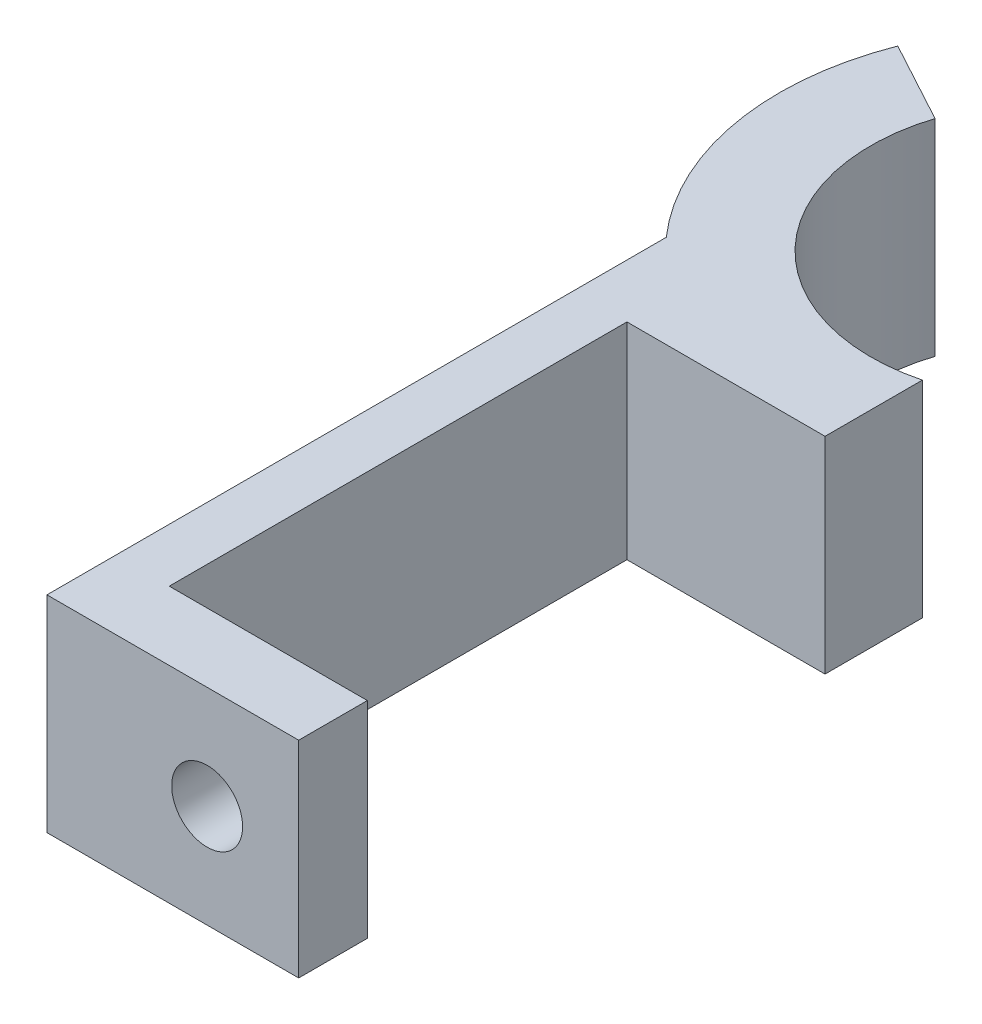
ISO-10303-21;
HEADER;
FILE_DESCRIPTION(('STEP AP214'),'2;1');
FILE_NAME('part.step','',(''),(''),'','','');
FILE_SCHEMA(('AUTOMOTIVE_DESIGN { 1 0 10303 214 1 1 1 1 }'));
ENDSEC;
DATA;
#1=APPLICATION_CONTEXT('core data for automotive mechanical design processes');
#2=APPLICATION_PROTOCOL_DEFINITION('international standard','automotive_design',2000,#1);
#3=PRODUCT_CONTEXT('',#1,'mechanical');
#4=PRODUCT('Part','Part','',(#3));
#5=PRODUCT_RELATED_PRODUCT_CATEGORY('part','',(#4));
#6=PRODUCT_DEFINITION_FORMATION('','',#4);
#7=PRODUCT_DEFINITION_CONTEXT('part definition',#1,'design');
#8=PRODUCT_DEFINITION('design','',#6,#7);
#9=PRODUCT_DEFINITION_SHAPE('','',#8);
#10=(LENGTH_UNIT() NAMED_UNIT(*) SI_UNIT(.MILLI.,.METRE.));
#11=(NAMED_UNIT(*) PLANE_ANGLE_UNIT() SI_UNIT($,.RADIAN.));
#12=(NAMED_UNIT(*) SI_UNIT($,.STERADIAN.) SOLID_ANGLE_UNIT());
#13=UNCERTAINTY_MEASURE_WITH_UNIT(LENGTH_MEASURE(1.E-05),#10,'distance_accuracy_value','');
#14=(GEOMETRIC_REPRESENTATION_CONTEXT(3) GLOBAL_UNCERTAINTY_ASSIGNED_CONTEXT((#13)) GLOBAL_UNIT_ASSIGNED_CONTEXT((#10,
#11,#12)) REPRESENTATION_CONTEXT('',''));
#15=CARTESIAN_POINT('',(0.,0.,0.));
#16=DIRECTION('',(0.,0.,1.));
#17=DIRECTION('',(1.,0.,0.));
#18=AXIS2_PLACEMENT_3D('',#15,#16,#17);
#19=CARTESIAN_POINT('',(9.30094670457775,9.,-17.1481964668759));
#20=DIRECTION('',(0.476772149483138,0.,-0.879026915103985));
#21=DIRECTION('',(-0.879026915103985,0.,-0.476772149483138));
#22=AXIS2_PLACEMENT_3D('',#19,#20,#21);
#23=PLANE('',#22);
#24=DIRECTION('',(0.879026915103985,0.,0.476772149483138));
#25=VECTOR('',#24,1.);
#26=CARTESIAN_POINT('',(9.30094670457775,0.,-17.1481964668759));
#27=LINE('',#26,#25);
#28=CARTESIAN_POINT('',(-7.68043173249966,0.,-26.3586633587506));
#29=VERTEX_POINT('',#28);
#30=CARTESIAN_POINT('',(-4.12238743204992,0.,-24.4288289021105));
#31=VERTEX_POINT('',#30);
#32=EDGE_CURVE('E153',#29,#31,#27,.T.);
#33=ORIENTED_EDGE('',*,*,#32,.F.);
#34=DIRECTION('',(0.,-1.,0.));
#35=VECTOR('',#34,1.);
#36=CARTESIAN_POINT('',(-7.68043173249966,9.,-26.3586633587506));
#37=LINE('',#36,#35);
#38=CARTESIAN_POINT('',(-7.68043173249966,9.,-26.3586633587506));
#39=VERTEX_POINT('',#38);
#40=EDGE_CURVE('E11',#39,#29,#37,.T.);
#41=ORIENTED_EDGE('',*,*,#40,.F.);
#42=DIRECTION('',(0.879026915103985,0.,0.476772149483138));
#43=VECTOR('',#42,1.);
#44=CARTESIAN_POINT('',(9.30094670457775,9.,-17.1481964668759));
#45=LINE('',#44,#43);
#46=CARTESIAN_POINT('',(-4.12238743204992,9.,-24.4288289021105));
#47=VERTEX_POINT('',#46);
#48=EDGE_CURVE('E189',#39,#47,#45,.T.);
#49=ORIENTED_EDGE('',*,*,#48,.T.);
#50=DIRECTION('',(0.,-1.,0.));
#51=VECTOR('',#50,1.);
#52=CARTESIAN_POINT('',(-4.12238743204992,9.,-24.4288289021105));
#53=LINE('',#52,#51);
#54=EDGE_CURVE('E59',#47,#31,#53,.T.);
#55=ORIENTED_EDGE('',*,*,#54,.T.);
#56=EDGE_LOOP('',(#33,#41,#49,#55));
#57=FACE_BOUND('',#56,.T.);
#58=ADVANCED_FACE('F41',(#57),#23,.T.);
#59=CARTESIAN_POINT('',(3.5,9.,-22.));
#60=DIRECTION('',(0.,-1.,0.));
#61=DIRECTION('',(0.,0.,-1.));
#62=AXIS2_PLACEMENT_3D('',#59,#60,#61);
#63=CYLINDRICAL_SURFACE('',#62,12.);
#64=CARTESIAN_POINT('',(3.5,0.,-22.));
#65=DIRECTION('',(0.,1.,0.));
#66=DIRECTION('',(0.,0.,1.));
#67=AXIS2_PLACEMENT_3D('',#64,#65,#66);
#68=CIRCLE('',#67,12.);
#69=CARTESIAN_POINT('',(-5.5,0.,-14.0627460668062));
#70=VERTEX_POINT('',#69);
#71=EDGE_CURVE('E156',#29,#70,#68,.T.);
#72=ORIENTED_EDGE('',*,*,#71,.T.);
#73=DIRECTION('',(0.,-1.,0.));
#74=VECTOR('',#73,1.);
#75=CARTESIAN_POINT('',(-5.5,9.,-14.0627460668062));
#76=LINE('',#75,#74);
#77=CARTESIAN_POINT('',(-5.5,9.,-14.0627460668062));
#78=VERTEX_POINT('',#77);
#79=EDGE_CURVE('E51',#78,#70,#76,.T.);
#80=ORIENTED_EDGE('',*,*,#79,.F.);
#81=CARTESIAN_POINT('',(3.5,9.,-22.));
#82=DIRECTION('',(0.,1.,0.));
#83=DIRECTION('',(0.,0.,1.));
#84=AXIS2_PLACEMENT_3D('',#81,#82,#83);
#85=CIRCLE('',#84,12.);
#86=EDGE_CURVE('E233',#39,#78,#85,.T.);
#87=ORIENTED_EDGE('',*,*,#86,.F.);
#88=ORIENTED_EDGE('',*,*,#40,.T.);
#89=EDGE_LOOP('',(#72,#80,#87,#88));
#90=FACE_BOUND('',#89,.T.);
#91=ADVANCED_FACE('F218',(#90),#63,.T.);
#92=CARTESIAN_POINT('',(-5.5,9.,0.));
#93=DIRECTION('',(-1.,0.,0.));
#94=DIRECTION('',(0.,0.,1.));
#95=AXIS2_PLACEMENT_3D('',#92,#93,#94);
#96=PLANE('',#95);
#97=DIRECTION('',(0.,0.,-1.));
#98=VECTOR('',#97,1.);
#99=CARTESIAN_POINT('',(-5.5,0.,0.));
#100=LINE('',#99,#98);
#101=CARTESIAN_POINT('',(-5.5,0.,13.));
#102=VERTEX_POINT('',#101);
#103=EDGE_CURVE('E160',#102,#70,#100,.T.);
#104=ORIENTED_EDGE('',*,*,#103,.F.);
#105=DIRECTION('',(0.,-1.,0.));
#106=VECTOR('',#105,1.);
#107=CARTESIAN_POINT('',(-5.5,9.,13.));
#108=LINE('',#107,#106);
#109=CARTESIAN_POINT('',(-5.5,9.,13.));
#110=VERTEX_POINT('',#109);
#111=EDGE_CURVE('E205',#110,#102,#108,.T.);
#112=ORIENTED_EDGE('',*,*,#111,.F.);
#113=DIRECTION('',(0.,0.,-1.));
#114=VECTOR('',#113,1.);
#115=CARTESIAN_POINT('',(-5.5,9.,0.));
#116=LINE('',#115,#114);
#117=EDGE_CURVE('E215',#110,#78,#116,.T.);
#118=ORIENTED_EDGE('',*,*,#117,.T.);
#119=ORIENTED_EDGE('',*,*,#79,.T.);
#120=EDGE_LOOP('',(#104,#112,#118,#119));
#121=FACE_BOUND('',#120,.T.);
#122=ADVANCED_FACE('F213',(#121),#96,.T.);
#123=CARTESIAN_POINT('',(0.,9.,13.));
#124=DIRECTION('',(0.,0.,-1.));
#125=DIRECTION('',(-1.,0.,0.));
#126=AXIS2_PLACEMENT_3D('',#123,#124,#125);
#127=PLANE('',#126);
#128=CARTESIAN_POINT('',(1.5,4.5,13.));
#129=DIRECTION('',(0.,0.,1.));
#130=DIRECTION('',(1.,0.,0.));
#131=AXIS2_PLACEMENT_3D('',#128,#129,#130);
#132=CIRCLE('',#131,1.55);
#133=CARTESIAN_POINT('',(3.05,4.5,13.));
#134=VERTEX_POINT('',#133);
#135=EDGE_CURVE('E344',#134,#134,#132,.T.);
#136=ORIENTED_EDGE('',*,*,#135,.F.);
#137=EDGE_LOOP('',(#136));
#138=FACE_BOUND('',#137,.T.);
#139=DIRECTION('',(1.,0.,0.));
#140=VECTOR('',#139,1.);
#141=CARTESIAN_POINT('',(0.,0.,13.));
#142=LINE('',#141,#140);
#143=CARTESIAN_POINT('',(5.5,0.,13.));
#144=VERTEX_POINT('',#143);
#145=EDGE_CURVE('E164',#102,#144,#142,.T.);
#146=ORIENTED_EDGE('',*,*,#145,.T.);
#147=DIRECTION('',(0.,-1.,0.));
#148=VECTOR('',#147,1.);
#149=CARTESIAN_POINT('',(5.5,9.,13.));
#150=LINE('',#149,#148);
#151=CARTESIAN_POINT('',(5.5,9.,13.));
#152=VERTEX_POINT('',#151);
#153=EDGE_CURVE('E202',#152,#144,#150,.T.);
#154=ORIENTED_EDGE('',*,*,#153,.F.);
#155=DIRECTION('',(1.,0.,0.));
#156=VECTOR('',#155,1.);
#157=CARTESIAN_POINT('',(0.,9.,13.));
#158=LINE('',#157,#156);
#159=EDGE_CURVE('E228',#110,#152,#158,.T.);
#160=ORIENTED_EDGE('',*,*,#159,.F.);
#161=ORIENTED_EDGE('',*,*,#111,.T.);
#162=EDGE_LOOP('',(#146,#154,#160,#161));
#163=FACE_BOUND('',#162,.T.);
#164=ADVANCED_FACE('F225',(#138,#163),#127,.F.);
#165=CARTESIAN_POINT('',(5.50000000000001,9.,0.));
#166=DIRECTION('',(1.,0.,0.));
#167=DIRECTION('',(0.,0.,-1.));
#168=AXIS2_PLACEMENT_3D('',#165,#166,#167);
#169=PLANE('',#168);
#170=DIRECTION('',(0.,0.,1.));
#171=VECTOR('',#170,1.);
#172=CARTESIAN_POINT('',(5.50000000000001,0.,0.));
#173=LINE('',#172,#171);
#174=CARTESIAN_POINT('',(5.5,0.,10.));
#175=VERTEX_POINT('',#174);
#176=EDGE_CURVE('E168',#175,#144,#173,.T.);
#177=ORIENTED_EDGE('',*,*,#176,.F.);
#178=DIRECTION('',(0.,-1.,0.));
#179=VECTOR('',#178,1.);
#180=CARTESIAN_POINT('',(5.5,9.,10.));
#181=LINE('',#180,#179);
#182=CARTESIAN_POINT('',(5.5,9.,10.));
#183=VERTEX_POINT('',#182);
#184=EDGE_CURVE('E199',#183,#175,#181,.T.);
#185=ORIENTED_EDGE('',*,*,#184,.F.);
#186=DIRECTION('',(0.,0.,1.));
#187=VECTOR('',#186,1.);
#188=CARTESIAN_POINT('',(5.50000000000001,9.,0.));
#189=LINE('',#188,#187);
#190=EDGE_CURVE('E231',#183,#152,#189,.T.);
#191=ORIENTED_EDGE('',*,*,#190,.T.);
#192=ORIENTED_EDGE('',*,*,#153,.T.);
#193=EDGE_LOOP('',(#177,#185,#191,#192));
#194=FACE_BOUND('',#193,.T.);
#195=ADVANCED_FACE('F271',(#194),#169,.T.);
#196=CARTESIAN_POINT('',(0.,9.,10.));
#197=DIRECTION('',(0.,0.,-1.));
#198=DIRECTION('',(-1.,0.,0.));
#199=AXIS2_PLACEMENT_3D('',#196,#197,#198);
#200=PLANE('',#199);
#201=CARTESIAN_POINT('',(1.5,4.5,10.));
#202=DIRECTION('',(0.,0.,-1.));
#203=DIRECTION('',(-1.,0.,0.));
#204=AXIS2_PLACEMENT_3D('',#201,#202,#203);
#205=CIRCLE('',#204,1.55);
#206=CARTESIAN_POINT('',(-0.0499999999999997,4.5,10.));
#207=VERTEX_POINT('',#206);
#208=EDGE_CURVE('E44',#207,#207,#205,.T.);
#209=ORIENTED_EDGE('',*,*,#208,.F.);
#210=EDGE_LOOP('',(#209));
#211=FACE_BOUND('',#210,.T.);
#212=DIRECTION('',(1.,0.,0.));
#213=VECTOR('',#212,1.);
#214=CARTESIAN_POINT('',(0.,0.,10.));
#215=LINE('',#214,#213);
#216=CARTESIAN_POINT('',(-3.15594387591767,0.,10.));
#217=VERTEX_POINT('',#216);
#218=EDGE_CURVE('E172',#217,#175,#215,.T.);
#219=ORIENTED_EDGE('',*,*,#218,.F.);
#220=DIRECTION('',(0.,-1.,0.));
#221=VECTOR('',#220,1.);
#222=CARTESIAN_POINT('',(-3.15594387591767,9.,10.));
#223=LINE('',#222,#221);
#224=CARTESIAN_POINT('',(-3.15594387591767,9.,10.));
#225=VERTEX_POINT('',#224);
#226=EDGE_CURVE('E196',#225,#217,#223,.T.);
#227=ORIENTED_EDGE('',*,*,#226,.F.);
#228=DIRECTION('',(1.,0.,0.));
#229=VECTOR('',#228,1.);
#230=CARTESIAN_POINT('',(0.,9.,10.));
#231=LINE('',#230,#229);
#232=EDGE_CURVE('E242',#225,#183,#231,.T.);
#233=ORIENTED_EDGE('',*,*,#232,.T.);
#234=ORIENTED_EDGE('',*,*,#184,.T.);
#235=EDGE_LOOP('',(#219,#227,#233,#234));
#236=FACE_BOUND('',#235,.T.);
#237=ADVANCED_FACE('F275',(#211,#236),#200,.T.);
#238=CARTESIAN_POINT('',(-3.15594387591767,9.,0.));
#239=DIRECTION('',(1.,0.,0.));
#240=DIRECTION('',(0.,0.,-1.));
#241=AXIS2_PLACEMENT_3D('',#238,#239,#240);
#242=PLANE('',#241);
#243=DIRECTION('',(0.,0.,1.));
#244=VECTOR('',#243,1.);
#245=CARTESIAN_POINT('',(-3.15594387591767,0.,0.));
#246=LINE('',#245,#244);
#247=CARTESIAN_POINT('',(-3.15594387591767,0.,-10.));
#248=VERTEX_POINT('',#247);
#249=EDGE_CURVE('E176',#248,#217,#246,.T.);
#250=ORIENTED_EDGE('',*,*,#249,.F.);
#251=DIRECTION('',(0.,-1.,0.));
#252=VECTOR('',#251,1.);
#253=CARTESIAN_POINT('',(-3.15594387591767,9.,-10.));
#254=LINE('',#253,#252);
#255=CARTESIAN_POINT('',(-3.15594387591767,9.,-10.));
#256=VERTEX_POINT('',#255);
#257=EDGE_CURVE('E131',#256,#248,#254,.T.);
#258=ORIENTED_EDGE('',*,*,#257,.F.);
#259=DIRECTION('',(0.,0.,1.));
#260=VECTOR('',#259,1.);
#261=CARTESIAN_POINT('',(-3.15594387591767,9.,0.));
#262=LINE('',#261,#260);
#263=EDGE_CURVE('E142',#256,#225,#262,.T.);
#264=ORIENTED_EDGE('',*,*,#263,.T.);
#265=ORIENTED_EDGE('',*,*,#226,.T.);
#266=EDGE_LOOP('',(#250,#258,#264,#265));
#267=FACE_BOUND('',#266,.T.);
#268=ADVANCED_FACE('F248',(#267),#242,.T.);
#269=CARTESIAN_POINT('',(0.,9.,-10.));
#270=DIRECTION('',(0.,0.,1.));
#271=DIRECTION('',(1.,0.,0.));
#272=AXIS2_PLACEMENT_3D('',#269,#270,#271);
#273=PLANE('',#272);
#274=DIRECTION('',(-1.,0.,0.));
#275=VECTOR('',#274,1.);
#276=CARTESIAN_POINT('',(0.,0.,-10.));
#277=LINE('',#276,#275);
#278=CARTESIAN_POINT('',(5.5,0.,-10.));
#279=VERTEX_POINT('',#278);
#280=EDGE_CURVE('E126',#279,#248,#277,.T.);
#281=ORIENTED_EDGE('',*,*,#280,.F.);
#282=DIRECTION('',(0.,-1.,0.));
#283=VECTOR('',#282,1.);
#284=CARTESIAN_POINT('',(5.5,9.,-10.));
#285=LINE('',#284,#283);
#286=CARTESIAN_POINT('',(5.5,9.,-10.));
#287=VERTEX_POINT('',#286);
#288=EDGE_CURVE('E121',#287,#279,#285,.T.);
#289=ORIENTED_EDGE('',*,*,#288,.F.);
#290=DIRECTION('',(-1.,0.,0.));
#291=VECTOR('',#290,1.);
#292=CARTESIAN_POINT('',(0.,9.,-10.));
#293=LINE('',#292,#291);
#294=EDGE_CURVE('E124',#287,#256,#293,.T.);
#295=ORIENTED_EDGE('',*,*,#294,.T.);
#296=ORIENTED_EDGE('',*,*,#257,.T.);
#297=EDGE_LOOP('',(#281,#289,#295,#296));
#298=FACE_BOUND('',#297,.T.);
#299=ADVANCED_FACE('F123',(#298),#273,.T.);
#300=CARTESIAN_POINT('',(5.5,9.,0.));
#301=DIRECTION('',(1.,0.,0.));
#302=DIRECTION('',(0.,0.,-1.));
#303=AXIS2_PLACEMENT_3D('',#300,#301,#302);
#304=PLANE('',#303);
#305=DIRECTION('',(0.,0.,1.));
#306=VECTOR('',#305,1.);
#307=CARTESIAN_POINT('',(5.5,0.,0.));
#308=LINE('',#307,#306);
#309=CARTESIAN_POINT('',(5.5,0.,-14.2540333075852));
#310=VERTEX_POINT('',#309);
#311=EDGE_CURVE('E182',#310,#279,#308,.T.);
#312=ORIENTED_EDGE('',*,*,#311,.F.);
#313=DIRECTION('',(0.,-1.,0.));
#314=VECTOR('',#313,1.);
#315=CARTESIAN_POINT('',(5.5,9.,-14.2540333075852));
#316=LINE('',#315,#314);
#317=CARTESIAN_POINT('',(5.5,9.,-14.2540333075852));
#318=VERTEX_POINT('',#317);
#319=EDGE_CURVE('E90',#318,#310,#316,.T.);
#320=ORIENTED_EDGE('',*,*,#319,.F.);
#321=DIRECTION('',(0.,0.,1.));
#322=VECTOR('',#321,1.);
#323=CARTESIAN_POINT('',(5.5,9.,0.));
#324=LINE('',#323,#322);
#325=EDGE_CURVE('E139',#318,#287,#324,.T.);
#326=ORIENTED_EDGE('',*,*,#325,.T.);
#327=ORIENTED_EDGE('',*,*,#288,.T.);
#328=EDGE_LOOP('',(#312,#320,#326,#327));
#329=FACE_BOUND('',#328,.T.);
#330=ADVANCED_FACE('F145',(#329),#304,.T.);
#331=CARTESIAN_POINT('',(3.5,9.,-22.));
#332=DIRECTION('',(0.,-1.,0.));
#333=DIRECTION('',(0.,0.,-1.));
#334=AXIS2_PLACEMENT_3D('',#331,#332,#333);
#335=CYLINDRICAL_SURFACE('',#334,8.);
#336=CARTESIAN_POINT('',(3.5,0.,-22.));
#337=DIRECTION('',(0.,1.,0.));
#338=DIRECTION('',(0.,0.,1.));
#339=AXIS2_PLACEMENT_3D('',#336,#337,#338);
#340=CIRCLE('',#339,8.);
#341=EDGE_CURVE('E185',#31,#310,#340,.T.);
#342=ORIENTED_EDGE('',*,*,#341,.F.);
#343=ORIENTED_EDGE('',*,*,#54,.F.);
#344=CARTESIAN_POINT('',(3.5,9.,-22.));
#345=DIRECTION('',(0.,1.,0.));
#346=DIRECTION('',(0.,0.,1.));
#347=AXIS2_PLACEMENT_3D('',#344,#345,#346);
#348=CIRCLE('',#347,8.);
#349=EDGE_CURVE('E147',#47,#318,#348,.T.);
#350=ORIENTED_EDGE('',*,*,#349,.T.);
#351=ORIENTED_EDGE('',*,*,#319,.T.);
#352=EDGE_LOOP('',(#342,#343,#350,#351));
#353=FACE_BOUND('',#352,.T.);
#354=ADVANCED_FACE('F250',(#353),#335,.F.);
#355=CARTESIAN_POINT('',(0.,9.,0.));
#356=DIRECTION('',(0.,1.,0.));
#357=DIRECTION('',(0.,0.,1.));
#358=AXIS2_PLACEMENT_3D('',#355,#356,#357);
#359=PLANE('',#358);
#360=ORIENTED_EDGE('',*,*,#48,.F.);
#361=ORIENTED_EDGE('',*,*,#86,.T.);
#362=ORIENTED_EDGE('',*,*,#117,.F.);
#363=ORIENTED_EDGE('',*,*,#159,.T.);
#364=ORIENTED_EDGE('',*,*,#190,.F.);
#365=ORIENTED_EDGE('',*,*,#232,.F.);
#366=ORIENTED_EDGE('',*,*,#263,.F.);
#367=ORIENTED_EDGE('',*,*,#294,.F.);
#368=ORIENTED_EDGE('',*,*,#325,.F.);
#369=ORIENTED_EDGE('',*,*,#349,.F.);
#370=EDGE_LOOP('',(#360,#361,#362,#363,#364,#365,#366,#367,#368,#369));
#371=FACE_BOUND('',#370,.T.);
#372=ADVANCED_FACE('F137',(#371),#359,.T.);
#373=CARTESIAN_POINT('',(0.,0.,0.));
#374=DIRECTION('',(0.,1.,0.));
#375=DIRECTION('',(0.,0.,1.));
#376=AXIS2_PLACEMENT_3D('',#373,#374,#375);
#377=PLANE('',#376);
#378=ORIENTED_EDGE('',*,*,#32,.T.);
#379=ORIENTED_EDGE('',*,*,#341,.T.);
#380=ORIENTED_EDGE('',*,*,#311,.T.);
#381=ORIENTED_EDGE('',*,*,#280,.T.);
#382=ORIENTED_EDGE('',*,*,#249,.T.);
#383=ORIENTED_EDGE('',*,*,#218,.T.);
#384=ORIENTED_EDGE('',*,*,#176,.T.);
#385=ORIENTED_EDGE('',*,*,#145,.F.);
#386=ORIENTED_EDGE('',*,*,#103,.T.);
#387=ORIENTED_EDGE('',*,*,#71,.F.);
#388=EDGE_LOOP('',(#378,#379,#380,#381,#382,#383,#384,#385,#386,#387));
#389=FACE_BOUND('',#388,.T.);
#390=ADVANCED_FACE('F221',(#389),#377,.F.);
#391=CARTESIAN_POINT('',(1.5,4.5,3.));
#392=DIRECTION('',(0.,0.,1.));
#393=DIRECTION('',(1.,0.,0.));
#394=AXIS2_PLACEMENT_3D('',#391,#392,#393);
#395=CYLINDRICAL_SURFACE('',#394,1.55);
#396=ORIENTED_EDGE('',*,*,#208,.T.);
#397=EDGE_LOOP('',(#396));
#398=FACE_BOUND('',#397,.T.);
#399=ORIENTED_EDGE('',*,*,#135,.T.);
#400=EDGE_LOOP('',(#399));
#401=FACE_BOUND('',#400,.T.);
#402=ADVANCED_FACE('F312',(#398,#401),#395,.F.);
#403=CLOSED_SHELL('',(#58,#91,#122,#164,#195,#237,#268,#299,#330,#354,#372,#390,#402));
#404=MANIFOLD_SOLID_BREP('B2',#403);
#405=ADVANCED_BREP_SHAPE_REPRESENTATION('',(#18,#404),#14);
#406=SHAPE_DEFINITION_REPRESENTATION(#9,#405);
ENDSEC;
END-ISO-10303-21;
